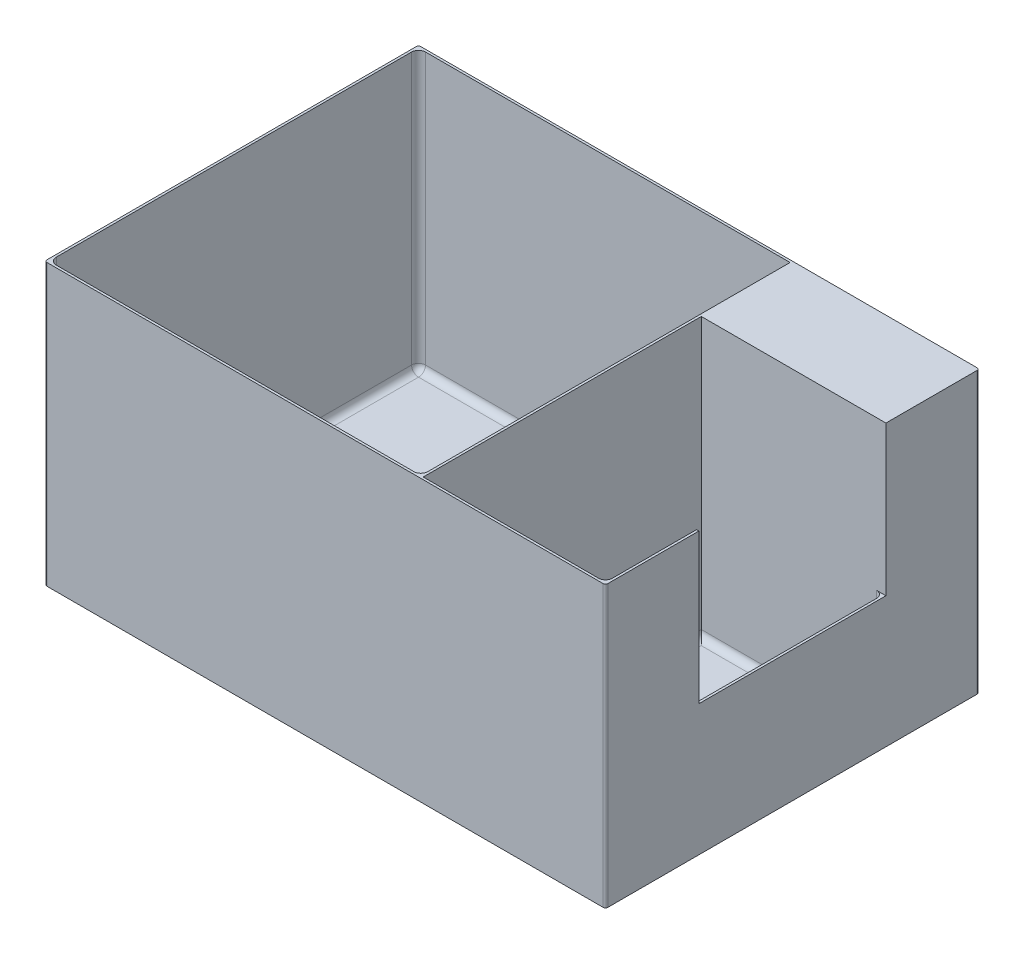
ISO-10303-21;
HEADER;
FILE_DESCRIPTION(('STEP AP214'),'2;1');
FILE_NAME('part.step','',(''),(''),'','','');
FILE_SCHEMA(('AUTOMOTIVE_DESIGN { 1 0 10303 214 1 1 1 1 }'));
ENDSEC;
DATA;
#1=APPLICATION_CONTEXT('core data for automotive mechanical design processes');
#2=APPLICATION_PROTOCOL_DEFINITION('international standard','automotive_design',2000,#1);
#3=PRODUCT_CONTEXT('',#1,'mechanical');
#4=PRODUCT('Part','Part','',(#3));
#5=PRODUCT_RELATED_PRODUCT_CATEGORY('part','',(#4));
#6=PRODUCT_DEFINITION_FORMATION('','',#4);
#7=PRODUCT_DEFINITION_CONTEXT('part definition',#1,'design');
#8=PRODUCT_DEFINITION('design','',#6,#7);
#9=PRODUCT_DEFINITION_SHAPE('','',#8);
#10=(LENGTH_UNIT() NAMED_UNIT(*) SI_UNIT(.MILLI.,.METRE.));
#11=(NAMED_UNIT(*) PLANE_ANGLE_UNIT() SI_UNIT($,.RADIAN.));
#12=(NAMED_UNIT(*) SI_UNIT($,.STERADIAN.) SOLID_ANGLE_UNIT());
#13=UNCERTAINTY_MEASURE_WITH_UNIT(LENGTH_MEASURE(1.E-05),#10,'distance_accuracy_value','');
#14=(GEOMETRIC_REPRESENTATION_CONTEXT(3) GLOBAL_UNCERTAINTY_ASSIGNED_CONTEXT((#13)) GLOBAL_UNIT_ASSIGNED_CONTEXT((#10,
#11,#12)) REPRESENTATION_CONTEXT('',''));
#15=CARTESIAN_POINT('',(0.,0.,0.));
#16=DIRECTION('',(0.,0.,1.));
#17=DIRECTION('',(1.,0.,0.));
#18=AXIS2_PLACEMENT_3D('',#15,#16,#17);
#19=CARTESIAN_POINT('',(120.,120.,80.));
#20=DIRECTION('',(-1.,0.,0.));
#21=DIRECTION('',(0.,0.,1.));
#22=AXIS2_PLACEMENT_3D('',#19,#20,#21);
#23=PLANE('',#22);
#24=DIRECTION('',(0.,0.,-1.));
#25=VECTOR('',#24,1.);
#26=CARTESIAN_POINT('',(120.,0.,80.));
#27=LINE('',#26,#25);
#28=CARTESIAN_POINT('',(120.,0.,79.));
#29=VERTEX_POINT('',#28);
#30=CARTESIAN_POINT('',(120.,0.,-79.));
#31=VERTEX_POINT('',#30);
#32=EDGE_CURVE('E284',#29,#31,#27,.T.);
#33=ORIENTED_EDGE('',*,*,#32,.T.);
#34=DIRECTION('',(0.,-1.,0.));
#35=VECTOR('',#34,1.);
#36=CARTESIAN_POINT('',(120.,120.,-79.));
#37=LINE('',#36,#35);
#38=CARTESIAN_POINT('',(120.,120.,-79.));
#39=VERTEX_POINT('',#38);
#40=EDGE_CURVE('E260',#31,#39,#37,.F.);
#41=ORIENTED_EDGE('',*,*,#40,.T.);
#42=DIRECTION('',(0.,0.,-1.));
#43=VECTOR('',#42,1.);
#44=CARTESIAN_POINT('',(120.,120.,80.));
#45=LINE('',#44,#43);
#46=CARTESIAN_POINT('',(120.,120.,-40.));
#47=VERTEX_POINT('',#46);
#48=EDGE_CURVE('E236',#47,#39,#45,.T.);
#49=ORIENTED_EDGE('',*,*,#48,.F.);
#50=DIRECTION('',(0.,1.,0.));
#51=VECTOR('',#50,1.);
#52=CARTESIAN_POINT('',(120.,56.,-40.));
#53=LINE('',#52,#51);
#54=CARTESIAN_POINT('',(120.,56.,-40.));
#55=VERTEX_POINT('',#54);
#56=EDGE_CURVE('E247',#55,#47,#53,.T.);
#57=ORIENTED_EDGE('',*,*,#56,.F.);
#58=DIRECTION('',(0.,0.,-1.));
#59=VECTOR('',#58,1.);
#60=CARTESIAN_POINT('',(120.,56.,40.));
#61=LINE('',#60,#59);
#62=CARTESIAN_POINT('',(120.,56.,40.));
#63=VERTEX_POINT('',#62);
#64=EDGE_CURVE('E581',#63,#55,#61,.T.);
#65=ORIENTED_EDGE('',*,*,#64,.F.);
#66=DIRECTION('',(0.,-1.,0.));
#67=VECTOR('',#66,1.);
#68=CARTESIAN_POINT('',(120.,56.,40.));
#69=LINE('',#68,#67);
#70=CARTESIAN_POINT('',(120.,120.,40.));
#71=VERTEX_POINT('',#70);
#72=EDGE_CURVE('E255',#71,#63,#69,.T.);
#73=ORIENTED_EDGE('',*,*,#72,.F.);
#74=CARTESIAN_POINT('',(120.,120.,79.));
#75=VERTEX_POINT('',#74);
#76=EDGE_CURVE('E262',#75,#71,#45,.T.);
#77=ORIENTED_EDGE('',*,*,#76,.F.);
#78=DIRECTION('',(0.,-1.,0.));
#79=VECTOR('',#78,1.);
#80=CARTESIAN_POINT('',(120.,120.,79.));
#81=LINE('',#80,#79);
#82=EDGE_CURVE('E332',#75,#29,#81,.T.);
#83=ORIENTED_EDGE('',*,*,#82,.T.);
#84=EDGE_LOOP('',(#33,#41,#49,#57,#65,#73,#77,#83));
#85=FACE_BOUND('',#84,.T.);
#86=ADVANCED_FACE('F43',(#85),#23,.F.);
#87=CARTESIAN_POINT('',(-120.,120.,-80.));
#88=DIRECTION('',(0.,0.,1.));
#89=DIRECTION('',(1.,0.,0.));
#90=AXIS2_PLACEMENT_3D('',#87,#88,#89);
#91=PLANE('',#90);
#92=DIRECTION('',(-1.,0.,0.));
#93=VECTOR('',#92,1.);
#94=CARTESIAN_POINT('',(-120.,0.,-80.));
#95=LINE('',#94,#93);
#96=CARTESIAN_POINT('',(119.,0.,-80.));
#97=VERTEX_POINT('',#96);
#98=CARTESIAN_POINT('',(-119.,0.,-80.));
#99=VERTEX_POINT('',#98);
#100=EDGE_CURVE('E287',#97,#99,#95,.T.);
#101=ORIENTED_EDGE('',*,*,#100,.T.);
#102=DIRECTION('',(0.,-1.,0.));
#103=VECTOR('',#102,1.);
#104=CARTESIAN_POINT('',(-119.,120.,-80.));
#105=LINE('',#104,#103);
#106=CARTESIAN_POINT('',(-119.,120.,-80.));
#107=VERTEX_POINT('',#106);
#108=EDGE_CURVE('E317',#99,#107,#105,.F.);
#109=ORIENTED_EDGE('',*,*,#108,.T.);
#110=DIRECTION('',(-1.,0.,0.));
#111=VECTOR('',#110,1.);
#112=CARTESIAN_POINT('',(-120.,120.,-80.));
#113=LINE('',#112,#111);
#114=CARTESIAN_POINT('',(119.,120.,-80.));
#115=VERTEX_POINT('',#114);
#116=EDGE_CURVE('E267',#115,#107,#113,.T.);
#117=ORIENTED_EDGE('',*,*,#116,.F.);
#118=DIRECTION('',(0.,-1.,0.));
#119=VECTOR('',#118,1.);
#120=CARTESIAN_POINT('',(119.,120.,-80.));
#121=LINE('',#120,#119);
#122=EDGE_CURVE('E313',#115,#97,#121,.T.);
#123=ORIENTED_EDGE('',*,*,#122,.T.);
#124=EDGE_LOOP('',(#101,#109,#117,#123));
#125=FACE_BOUND('',#124,.T.);
#126=ADVANCED_FACE('F631',(#125),#91,.F.);
#127=CARTESIAN_POINT('',(-120.,120.,80.));
#128=DIRECTION('',(1.,0.,0.));
#129=DIRECTION('',(0.,0.,-1.));
#130=AXIS2_PLACEMENT_3D('',#127,#128,#129);
#131=PLANE('',#130);
#132=DIRECTION('',(0.,0.,1.));
#133=VECTOR('',#132,1.);
#134=CARTESIAN_POINT('',(-120.,120.,80.));
#135=LINE('',#134,#133);
#136=CARTESIAN_POINT('',(-120.,120.,-79.));
#137=VERTEX_POINT('',#136);
#138=CARTESIAN_POINT('',(-120.,120.,79.));
#139=VERTEX_POINT('',#138);
#140=EDGE_CURVE('E275',#137,#139,#135,.T.);
#141=ORIENTED_EDGE('',*,*,#140,.F.);
#142=DIRECTION('',(0.,-1.,0.));
#143=VECTOR('',#142,1.);
#144=CARTESIAN_POINT('',(-120.,120.,-79.));
#145=LINE('',#144,#143);
#146=CARTESIAN_POINT('',(-120.,0.,-79.));
#147=VERTEX_POINT('',#146);
#148=EDGE_CURVE('E297',#137,#147,#145,.T.);
#149=ORIENTED_EDGE('',*,*,#148,.T.);
#150=DIRECTION('',(0.,0.,1.));
#151=VECTOR('',#150,1.);
#152=CARTESIAN_POINT('',(-120.,0.,80.));
#153=LINE('',#152,#151);
#154=CARTESIAN_POINT('',(-120.,0.,79.));
#155=VERTEX_POINT('',#154);
#156=EDGE_CURVE('E269',#147,#155,#153,.T.);
#157=ORIENTED_EDGE('',*,*,#156,.T.);
#158=DIRECTION('',(0.,-1.,0.));
#159=VECTOR('',#158,1.);
#160=CARTESIAN_POINT('',(-120.,120.,79.));
#161=LINE('',#160,#159);
#162=EDGE_CURVE('E283',#155,#139,#161,.F.);
#163=ORIENTED_EDGE('',*,*,#162,.T.);
#164=EDGE_LOOP('',(#141,#149,#157,#163));
#165=FACE_BOUND('',#164,.T.);
#166=ADVANCED_FACE('F623',(#165),#131,.F.);
#167=CARTESIAN_POINT('',(-120.,120.,80.));
#168=DIRECTION('',(0.,0.,-1.));
#169=DIRECTION('',(-1.,0.,0.));
#170=AXIS2_PLACEMENT_3D('',#167,#168,#169);
#171=PLANE('',#170);
#172=DIRECTION('',(1.,0.,0.));
#173=VECTOR('',#172,1.);
#174=CARTESIAN_POINT('',(-120.,120.,80.));
#175=LINE('',#174,#173);
#176=CARTESIAN_POINT('',(-119.,120.,80.));
#177=VERTEX_POINT('',#176);
#178=CARTESIAN_POINT('',(119.,120.,80.));
#179=VERTEX_POINT('',#178);
#180=EDGE_CURVE('E279',#177,#179,#175,.T.);
#181=ORIENTED_EDGE('',*,*,#180,.F.);
#182=DIRECTION('',(0.,-1.,0.));
#183=VECTOR('',#182,1.);
#184=CARTESIAN_POINT('',(-119.,120.,80.));
#185=LINE('',#184,#183);
#186=CARTESIAN_POINT('',(-119.,0.,80.));
#187=VERTEX_POINT('',#186);
#188=EDGE_CURVE('E341',#177,#187,#185,.T.);
#189=ORIENTED_EDGE('',*,*,#188,.T.);
#190=DIRECTION('',(1.,0.,0.));
#191=VECTOR('',#190,1.);
#192=CARTESIAN_POINT('',(-120.,0.,80.));
#193=LINE('',#192,#191);
#194=CARTESIAN_POINT('',(119.,0.,80.));
#195=VERTEX_POINT('',#194);
#196=EDGE_CURVE('E263',#187,#195,#193,.T.);
#197=ORIENTED_EDGE('',*,*,#196,.T.);
#198=DIRECTION('',(0.,-1.,0.));
#199=VECTOR('',#198,1.);
#200=CARTESIAN_POINT('',(119.,120.,80.));
#201=LINE('',#200,#199);
#202=EDGE_CURVE('E338',#195,#179,#201,.F.);
#203=ORIENTED_EDGE('',*,*,#202,.T.);
#204=EDGE_LOOP('',(#181,#189,#197,#203));
#205=FACE_BOUND('',#204,.T.);
#206=ADVANCED_FACE('F615',(#205),#171,.F.);
#207=CARTESIAN_POINT('',(0.,120.,0.));
#208=DIRECTION('',(0.,-1.,0.));
#209=DIRECTION('',(0.,0.,-1.));
#210=AXIS2_PLACEMENT_3D('',#207,#208,#209);
#211=PLANE('',#210);
#212=DIRECTION('',(-1.,0.,0.));
#213=VECTOR('',#212,1.);
#214=CARTESIAN_POINT('',(-119.,120.,-79.));
#215=LINE('',#214,#213);
#216=CARTESIAN_POINT('',(40.,120.,-79.));
#217=VERTEX_POINT('',#216);
#218=CARTESIAN_POINT('',(-116.,120.,-79.));
#219=VERTEX_POINT('',#218);
#220=EDGE_CURVE('E561',#217,#219,#215,.T.);
#221=ORIENTED_EDGE('',*,*,#220,.F.);
#222=DIRECTION('',(0.,0.,-1.));
#223=VECTOR('',#222,1.);
#224=CARTESIAN_POINT('',(40.,120.,79.));
#225=LINE('',#224,#223);
#226=CARTESIAN_POINT('',(40.,120.,76.));
#227=VERTEX_POINT('',#226);
#228=EDGE_CURVE('E558',#227,#217,#225,.T.);
#229=ORIENTED_EDGE('',*,*,#228,.F.);
#230=CARTESIAN_POINT('',(37.,120.,76.));
#231=DIRECTION('',(0.,-1.,0.));
#232=DIRECTION('',(0.,0.,-1.));
#233=AXIS2_PLACEMENT_3D('',#230,#231,#232);
#234=CIRCLE('',#233,3.);
#235=CARTESIAN_POINT('',(37.,120.,79.));
#236=VERTEX_POINT('',#235);
#237=EDGE_CURVE('E424',#227,#236,#234,.T.);
#238=ORIENTED_EDGE('',*,*,#237,.T.);
#239=DIRECTION('',(1.,0.,0.));
#240=VECTOR('',#239,1.);
#241=CARTESIAN_POINT('',(-119.,120.,79.));
#242=LINE('',#241,#240);
#243=CARTESIAN_POINT('',(-116.,120.,79.));
#244=VERTEX_POINT('',#243);
#245=EDGE_CURVE('E569',#244,#236,#242,.T.);
#246=ORIENTED_EDGE('',*,*,#245,.F.);
#247=CARTESIAN_POINT('',(-116.,120.,76.));
#248=DIRECTION('',(0.,-1.,0.));
#249=DIRECTION('',(0.,0.,-1.));
#250=AXIS2_PLACEMENT_3D('',#247,#248,#249);
#251=CIRCLE('',#250,3.);
#252=CARTESIAN_POINT('',(-119.,120.,76.));
#253=VERTEX_POINT('',#252);
#254=EDGE_CURVE('E427',#244,#253,#251,.T.);
#255=ORIENTED_EDGE('',*,*,#254,.T.);
#256=DIRECTION('',(0.,0.,1.));
#257=VECTOR('',#256,1.);
#258=CARTESIAN_POINT('',(-119.,120.,79.));
#259=LINE('',#258,#257);
#260=CARTESIAN_POINT('',(-119.,120.,-76.));
#261=VERTEX_POINT('',#260);
#262=EDGE_CURVE('E565',#261,#253,#259,.T.);
#263=ORIENTED_EDGE('',*,*,#262,.F.);
#264=CARTESIAN_POINT('',(-116.,120.,-76.));
#265=DIRECTION('',(0.,-1.,0.));
#266=DIRECTION('',(0.,0.,-1.));
#267=AXIS2_PLACEMENT_3D('',#264,#265,#266);
#268=CIRCLE('',#267,3.);
#269=EDGE_CURVE('E430',#261,#219,#268,.T.);
#270=ORIENTED_EDGE('',*,*,#269,.T.);
#271=EDGE_LOOP('',(#221,#229,#238,#246,#255,#263,#270));
#272=FACE_BOUND('',#271,.T.);
#273=ORIENTED_EDGE('',*,*,#116,.T.);
#274=CARTESIAN_POINT('',(-119.,120.,-79.));
#275=DIRECTION('',(0.,-1.,0.));
#276=DIRECTION('',(0.,0.,-1.));
#277=AXIS2_PLACEMENT_3D('',#274,#275,#276);
#278=CIRCLE('',#277,1.);
#279=EDGE_CURVE('E329',#107,#137,#278,.F.);
#280=ORIENTED_EDGE('',*,*,#279,.T.);
#281=ORIENTED_EDGE('',*,*,#140,.T.);
#282=CARTESIAN_POINT('',(-119.,120.,79.));
#283=DIRECTION('',(0.,-1.,0.));
#284=DIRECTION('',(0.,0.,-1.));
#285=AXIS2_PLACEMENT_3D('',#282,#283,#284);
#286=CIRCLE('',#285,1.);
#287=EDGE_CURVE('E323',#139,#177,#286,.F.);
#288=ORIENTED_EDGE('',*,*,#287,.T.);
#289=ORIENTED_EDGE('',*,*,#180,.T.);
#290=CARTESIAN_POINT('',(119.,120.,79.));
#291=DIRECTION('',(0.,-1.,0.));
#292=DIRECTION('',(0.,0.,-1.));
#293=AXIS2_PLACEMENT_3D('',#290,#291,#292);
#294=CIRCLE('',#293,1.);
#295=EDGE_CURVE('E320',#179,#75,#294,.F.);
#296=ORIENTED_EDGE('',*,*,#295,.T.);
#297=ORIENTED_EDGE('',*,*,#76,.T.);
#298=DIRECTION('',(1.,0.,0.));
#299=VECTOR('',#298,1.);
#300=CARTESIAN_POINT('',(-120.001,120.,40.));
#301=LINE('',#300,#299);
#302=CARTESIAN_POINT('',(119.,120.,40.));
#303=VERTEX_POINT('',#302);
#304=EDGE_CURVE('E577',#303,#71,#301,.T.);
#305=ORIENTED_EDGE('',*,*,#304,.F.);
#306=DIRECTION('',(0.,0.,-1.));
#307=VECTOR('',#306,1.);
#308=CARTESIAN_POINT('',(119.,120.,79.));
#309=LINE('',#308,#307);
#310=CARTESIAN_POINT('',(119.,120.,76.));
#311=VERTEX_POINT('',#310);
#312=EDGE_CURVE('E244',#311,#303,#309,.T.);
#313=ORIENTED_EDGE('',*,*,#312,.F.);
#314=CARTESIAN_POINT('',(116.,120.,76.));
#315=DIRECTION('',(0.,-1.,0.));
#316=DIRECTION('',(0.,0.,-1.));
#317=AXIS2_PLACEMENT_3D('',#314,#315,#316);
#318=CIRCLE('',#317,3.);
#319=CARTESIAN_POINT('',(116.,120.,79.));
#320=VERTEX_POINT('',#319);
#321=EDGE_CURVE('E11',#311,#320,#318,.T.);
#322=ORIENTED_EDGE('',*,*,#321,.T.);
#323=DIRECTION('',(1.,0.,0.));
#324=VECTOR('',#323,1.);
#325=CARTESIAN_POINT('',(41.,120.,79.));
#326=LINE('',#325,#324);
#327=CARTESIAN_POINT('',(41.,120.,79.));
#328=VERTEX_POINT('',#327);
#329=EDGE_CURVE('E547',#328,#320,#326,.T.);
#330=ORIENTED_EDGE('',*,*,#329,.F.);
#331=DIRECTION('',(0.,0.,1.));
#332=VECTOR('',#331,1.);
#333=CARTESIAN_POINT('',(41.,120.,79.));
#334=LINE('',#333,#332);
#335=CARTESIAN_POINT('',(41.,120.,-40.));
#336=VERTEX_POINT('',#335);
#337=EDGE_CURVE('E240',#336,#328,#334,.T.);
#338=ORIENTED_EDGE('',*,*,#337,.F.);
#339=DIRECTION('',(-1.,0.,0.));
#340=VECTOR('',#339,1.);
#341=CARTESIAN_POINT('',(41.,120.,-40.));
#342=LINE('',#341,#340);
#343=EDGE_CURVE('E231',#47,#336,#342,.T.);
#344=ORIENTED_EDGE('',*,*,#343,.F.);
#345=ORIENTED_EDGE('',*,*,#48,.T.);
#346=CARTESIAN_POINT('',(119.,120.,-79.));
#347=DIRECTION('',(0.,-1.,0.));
#348=DIRECTION('',(0.,0.,-1.));
#349=AXIS2_PLACEMENT_3D('',#346,#347,#348);
#350=CIRCLE('',#349,1.);
#351=EDGE_CURVE('E326',#39,#115,#350,.F.);
#352=ORIENTED_EDGE('',*,*,#351,.T.);
#353=EDGE_LOOP('',(#273,#280,#281,#288,#289,#296,#297,#305,#313,#322,#330,#338,#344,#345,#352));
#354=FACE_BOUND('',#353,.T.);
#355=ADVANCED_FACE('F234',(#272,#354),#211,.F.);
#356=CARTESIAN_POINT('',(0.,0.,0.));
#357=DIRECTION('',(0.,-1.,0.));
#358=DIRECTION('',(0.,0.,-1.));
#359=AXIS2_PLACEMENT_3D('',#356,#357,#358);
#360=PLANE('',#359);
#361=ORIENTED_EDGE('',*,*,#156,.F.);
#362=CARTESIAN_POINT('',(-119.,0.,-79.));
#363=DIRECTION('',(0.,-1.,0.));
#364=DIRECTION('',(0.,0.,-1.));
#365=AXIS2_PLACEMENT_3D('',#362,#363,#364);
#366=CIRCLE('',#365,1.);
#367=EDGE_CURVE('E310',#147,#99,#366,.T.);
#368=ORIENTED_EDGE('',*,*,#367,.T.);
#369=ORIENTED_EDGE('',*,*,#100,.F.);
#370=CARTESIAN_POINT('',(119.,0.,-79.));
#371=DIRECTION('',(0.,-1.,0.));
#372=DIRECTION('',(0.,0.,-1.));
#373=AXIS2_PLACEMENT_3D('',#370,#371,#372);
#374=CIRCLE('',#373,1.);
#375=EDGE_CURVE('E307',#97,#31,#374,.T.);
#376=ORIENTED_EDGE('',*,*,#375,.T.);
#377=ORIENTED_EDGE('',*,*,#32,.F.);
#378=CARTESIAN_POINT('',(119.,0.,79.));
#379=DIRECTION('',(0.,-1.,0.));
#380=DIRECTION('',(0.,0.,-1.));
#381=AXIS2_PLACEMENT_3D('',#378,#379,#380);
#382=CIRCLE('',#381,1.);
#383=EDGE_CURVE('E301',#29,#195,#382,.T.);
#384=ORIENTED_EDGE('',*,*,#383,.T.);
#385=ORIENTED_EDGE('',*,*,#196,.F.);
#386=CARTESIAN_POINT('',(-119.,0.,79.));
#387=DIRECTION('',(0.,-1.,0.));
#388=DIRECTION('',(0.,0.,-1.));
#389=AXIS2_PLACEMENT_3D('',#386,#387,#388);
#390=CIRCLE('',#389,1.);
#391=EDGE_CURVE('E304',#187,#155,#390,.T.);
#392=ORIENTED_EDGE('',*,*,#391,.T.);
#393=EDGE_LOOP('',(#361,#368,#369,#376,#377,#384,#385,#392));
#394=FACE_BOUND('',#393,.T.);
#395=ADVANCED_FACE('F612',(#394),#360,.T.);
#396=CARTESIAN_POINT('',(119.,1.,79.));
#397=DIRECTION('',(1.,0.,0.));
#398=DIRECTION('',(0.,0.,-1.));
#399=AXIS2_PLACEMENT_3D('',#396,#397,#398);
#400=PLANE('',#399);
#401=DIRECTION('',(0.,0.,1.));
#402=VECTOR('',#401,1.);
#403=CARTESIAN_POINT('',(119.,56.,40.));
#404=LINE('',#403,#402);
#405=CARTESIAN_POINT('',(119.,56.,-37.));
#406=VERTEX_POINT('',#405);
#407=CARTESIAN_POINT('',(119.,56.,40.));
#408=VERTEX_POINT('',#407);
#409=EDGE_CURVE('E256',#406,#408,#404,.T.);
#410=ORIENTED_EDGE('',*,*,#409,.F.);
#411=DIRECTION('',(0.,1.,0.));
#412=VECTOR('',#411,1.);
#413=CARTESIAN_POINT('',(119.,1.,-37.));
#414=LINE('',#413,#412);
#415=CARTESIAN_POINT('',(119.,4.,-37.));
#416=VERTEX_POINT('',#415);
#417=EDGE_CURVE('E388',#406,#416,#414,.F.);
#418=ORIENTED_EDGE('',*,*,#417,.T.);
#419=DIRECTION('',(0.,0.,-1.));
#420=VECTOR('',#419,1.);
#421=CARTESIAN_POINT('',(119.,4.,79.));
#422=LINE('',#421,#420);
#423=CARTESIAN_POINT('',(119.,4.,76.));
#424=VERTEX_POINT('',#423);
#425=EDGE_CURVE('E382',#416,#424,#422,.F.);
#426=ORIENTED_EDGE('',*,*,#425,.T.);
#427=DIRECTION('',(0.,1.,0.));
#428=VECTOR('',#427,1.);
#429=CARTESIAN_POINT('',(119.,120.,76.));
#430=LINE('',#429,#428);
#431=EDGE_CURVE('E385',#424,#311,#430,.T.);
#432=ORIENTED_EDGE('',*,*,#431,.T.);
#433=ORIENTED_EDGE('',*,*,#312,.T.);
#434=DIRECTION('',(0.,1.,0.));
#435=VECTOR('',#434,1.);
#436=CARTESIAN_POINT('',(119.,56.,40.));
#437=LINE('',#436,#435);
#438=EDGE_CURVE('E474',#408,#303,#437,.T.);
#439=ORIENTED_EDGE('',*,*,#438,.F.);
#440=EDGE_LOOP('',(#410,#418,#426,#432,#433,#439));
#441=FACE_BOUND('',#440,.T.);
#442=ADVANCED_FACE('F657',(#441),#400,.F.);
#443=CARTESIAN_POINT('',(41.,1.,79.));
#444=DIRECTION('',(0.,0.,1.));
#445=DIRECTION('',(1.,0.,0.));
#446=AXIS2_PLACEMENT_3D('',#443,#444,#445);
#447=PLANE('',#446);
#448=ORIENTED_EDGE('',*,*,#329,.T.);
#449=DIRECTION('',(0.,1.,0.));
#450=VECTOR('',#449,1.);
#451=CARTESIAN_POINT('',(116.,1.,79.));
#452=LINE('',#451,#450);
#453=CARTESIAN_POINT('',(116.,4.,79.));
#454=VERTEX_POINT('',#453);
#455=EDGE_CURVE('E394',#320,#454,#452,.F.);
#456=ORIENTED_EDGE('',*,*,#455,.T.);
#457=DIRECTION('',(1.,0.,0.));
#458=VECTOR('',#457,1.);
#459=CARTESIAN_POINT('',(41.,4.,79.));
#460=LINE('',#459,#458);
#461=CARTESIAN_POINT('',(41.,4.,79.));
#462=VERTEX_POINT('',#461);
#463=EDGE_CURVE('E391',#454,#462,#460,.F.);
#464=ORIENTED_EDGE('',*,*,#463,.T.);
#465=DIRECTION('',(0.,1.,0.));
#466=VECTOR('',#465,1.);
#467=CARTESIAN_POINT('',(41.,1.,79.));
#468=LINE('',#467,#466);
#469=EDGE_CURVE('E540',#462,#328,#468,.T.);
#470=ORIENTED_EDGE('',*,*,#469,.T.);
#471=EDGE_LOOP('',(#448,#456,#464,#470));
#472=FACE_BOUND('',#471,.T.);
#473=ADVANCED_FACE('F539',(#472),#447,.F.);
#474=CARTESIAN_POINT('',(41.,1.,79.));
#475=DIRECTION('',(-1.,0.,0.));
#476=DIRECTION('',(0.,0.,1.));
#477=AXIS2_PLACEMENT_3D('',#474,#475,#476);
#478=PLANE('',#477);
#479=ORIENTED_EDGE('',*,*,#469,.F.);
#480=DIRECTION('',(0.,0.,1.));
#481=VECTOR('',#480,1.);
#482=CARTESIAN_POINT('',(41.,4.,-40.));
#483=LINE('',#482,#481);
#484=CARTESIAN_POINT('',(41.,4.,-40.));
#485=VERTEX_POINT('',#484);
#486=EDGE_CURVE('E421',#462,#485,#483,.F.);
#487=ORIENTED_EDGE('',*,*,#486,.T.);
#488=DIRECTION('',(0.,1.,0.));
#489=VECTOR('',#488,1.);
#490=CARTESIAN_POINT('',(41.,1.,-40.));
#491=LINE('',#490,#489);
#492=EDGE_CURVE('E522',#485,#336,#491,.T.);
#493=ORIENTED_EDGE('',*,*,#492,.T.);
#494=ORIENTED_EDGE('',*,*,#337,.T.);
#495=EDGE_LOOP('',(#479,#487,#493,#494));
#496=FACE_BOUND('',#495,.T.);
#497=ADVANCED_FACE('F542',(#496),#478,.F.);
#498=CARTESIAN_POINT('',(41.,1.,-40.));
#499=DIRECTION('',(0.,0.,-1.));
#500=DIRECTION('',(-1.,0.,0.));
#501=AXIS2_PLACEMENT_3D('',#498,#499,#500);
#502=PLANE('',#501);
#503=DIRECTION('',(0.,1.,0.));
#504=VECTOR('',#503,1.);
#505=CARTESIAN_POINT('',(116.,56.,-40.));
#506=LINE('',#505,#504);
#507=CARTESIAN_POINT('',(116.,4.,-40.));
#508=VERTEX_POINT('',#507);
#509=CARTESIAN_POINT('',(116.,56.,-40.));
#510=VERTEX_POINT('',#509);
#511=EDGE_CURVE('E379',#508,#510,#506,.T.);
#512=ORIENTED_EDGE('',*,*,#511,.T.);
#513=DIRECTION('',(1.,0.,0.));
#514=VECTOR('',#513,1.);
#515=CARTESIAN_POINT('',(-120.001,56.,-40.));
#516=LINE('',#515,#514);
#517=EDGE_CURVE('E250',#510,#55,#516,.T.);
#518=ORIENTED_EDGE('',*,*,#517,.T.);
#519=ORIENTED_EDGE('',*,*,#56,.T.);
#520=ORIENTED_EDGE('',*,*,#343,.T.);
#521=ORIENTED_EDGE('',*,*,#492,.F.);
#522=DIRECTION('',(-1.,0.,0.));
#523=VECTOR('',#522,1.);
#524=CARTESIAN_POINT('',(119.,4.,-40.));
#525=LINE('',#524,#523);
#526=EDGE_CURVE('E376',#485,#508,#525,.F.);
#527=ORIENTED_EDGE('',*,*,#526,.T.);
#528=EDGE_LOOP('',(#512,#518,#519,#520,#521,#527));
#529=FACE_BOUND('',#528,.T.);
#530=ADVANCED_FACE('F249',(#529),#502,.F.);
#531=CARTESIAN_POINT('',(0.,1.,0.));
#532=DIRECTION('',(0.,-1.,0.));
#533=DIRECTION('',(0.,0.,-1.));
#534=AXIS2_PLACEMENT_3D('',#531,#532,#533);
#535=PLANE('',#534);
#536=DIRECTION('',(0.,0.,1.));
#537=VECTOR('',#536,1.);
#538=CARTESIAN_POINT('',(44.,1.,79.));
#539=LINE('',#538,#537);
#540=CARTESIAN_POINT('',(44.,1.,-37.));
#541=VERTEX_POINT('',#540);
#542=CARTESIAN_POINT('',(44.,1.,76.));
#543=VERTEX_POINT('',#542);
#544=EDGE_CURVE('E410',#541,#543,#539,.T.);
#545=ORIENTED_EDGE('',*,*,#544,.T.);
#546=DIRECTION('',(1.,0.,0.));
#547=VECTOR('',#546,1.);
#548=CARTESIAN_POINT('',(119.,1.,76.));
#549=LINE('',#548,#547);
#550=CARTESIAN_POINT('',(116.,1.,76.));
#551=VERTEX_POINT('',#550);
#552=EDGE_CURVE('E418',#543,#551,#549,.T.);
#553=ORIENTED_EDGE('',*,*,#552,.T.);
#554=DIRECTION('',(0.,0.,-1.));
#555=VECTOR('',#554,1.);
#556=CARTESIAN_POINT('',(116.,1.,-40.));
#557=LINE('',#556,#555);
#558=CARTESIAN_POINT('',(116.,1.,-37.));
#559=VERTEX_POINT('',#558);
#560=EDGE_CURVE('E61',#551,#559,#557,.T.);
#561=ORIENTED_EDGE('',*,*,#560,.T.);
#562=DIRECTION('',(-1.,0.,0.));
#563=VECTOR('',#562,1.);
#564=CARTESIAN_POINT('',(41.,1.,-37.));
#565=LINE('',#564,#563);
#566=EDGE_CURVE('E413',#559,#541,#565,.T.);
#567=ORIENTED_EDGE('',*,*,#566,.T.);
#568=EDGE_LOOP('',(#545,#553,#561,#567));
#569=FACE_BOUND('',#568,.T.);
#570=ADVANCED_FACE('F527',(#569),#535,.F.);
#571=CARTESIAN_POINT('',(40.,1.,79.));
#572=DIRECTION('',(1.,0.,0.));
#573=DIRECTION('',(0.,0.,-1.));
#574=AXIS2_PLACEMENT_3D('',#571,#572,#573);
#575=PLANE('',#574);
#576=DIRECTION('',(0.,0.,-1.));
#577=VECTOR('',#576,1.);
#578=CARTESIAN_POINT('',(40.,4.,79.));
#579=LINE('',#578,#577);
#580=CARTESIAN_POINT('',(40.,4.,-79.));
#581=VERTEX_POINT('',#580);
#582=CARTESIAN_POINT('',(40.,4.,76.));
#583=VERTEX_POINT('',#582);
#584=EDGE_CURVE('E345',#581,#583,#579,.F.);
#585=ORIENTED_EDGE('',*,*,#584,.T.);
#586=DIRECTION('',(0.,1.,0.));
#587=VECTOR('',#586,1.);
#588=CARTESIAN_POINT('',(40.,120.,76.));
#589=LINE('',#588,#587);
#590=EDGE_CURVE('E348',#583,#227,#589,.T.);
#591=ORIENTED_EDGE('',*,*,#590,.T.);
#592=ORIENTED_EDGE('',*,*,#228,.T.);
#593=DIRECTION('',(0.,1.,0.));
#594=VECTOR('',#593,1.);
#595=CARTESIAN_POINT('',(40.,1.,-79.));
#596=LINE('',#595,#594);
#597=EDGE_CURVE('E288',#581,#217,#596,.T.);
#598=ORIENTED_EDGE('',*,*,#597,.F.);
#599=EDGE_LOOP('',(#585,#591,#592,#598));
#600=FACE_BOUND('',#599,.T.);
#601=ADVANCED_FACE('F663',(#600),#575,.F.);
#602=CARTESIAN_POINT('',(-119.,1.,79.));
#603=DIRECTION('',(0.,0.,1.));
#604=DIRECTION('',(1.,0.,0.));
#605=AXIS2_PLACEMENT_3D('',#602,#603,#604);
#606=PLANE('',#605);
#607=ORIENTED_EDGE('',*,*,#245,.T.);
#608=DIRECTION('',(0.,1.,0.));
#609=VECTOR('',#608,1.);
#610=CARTESIAN_POINT('',(37.,1.,79.));
#611=LINE('',#610,#609);
#612=CARTESIAN_POINT('',(37.,4.,79.));
#613=VERTEX_POINT('',#612);
#614=EDGE_CURVE('E358',#236,#613,#611,.F.);
#615=ORIENTED_EDGE('',*,*,#614,.T.);
#616=DIRECTION('',(1.,0.,0.));
#617=VECTOR('',#616,1.);
#618=CARTESIAN_POINT('',(-119.,4.,79.));
#619=LINE('',#618,#617);
#620=CARTESIAN_POINT('',(-116.,4.,79.));
#621=VERTEX_POINT('',#620);
#622=EDGE_CURVE('E352',#613,#621,#619,.F.);
#623=ORIENTED_EDGE('',*,*,#622,.T.);
#624=DIRECTION('',(0.,1.,0.));
#625=VECTOR('',#624,1.);
#626=CARTESIAN_POINT('',(-116.,120.,79.));
#627=LINE('',#626,#625);
#628=EDGE_CURVE('E355',#621,#244,#627,.T.);
#629=ORIENTED_EDGE('',*,*,#628,.T.);
#630=EDGE_LOOP('',(#607,#615,#623,#629));
#631=FACE_BOUND('',#630,.T.);
#632=ADVANCED_FACE('F674',(#631),#606,.F.);
#633=CARTESIAN_POINT('',(-119.,1.,79.));
#634=DIRECTION('',(-1.,0.,0.));
#635=DIRECTION('',(0.,0.,1.));
#636=AXIS2_PLACEMENT_3D('',#633,#634,#635);
#637=PLANE('',#636);
#638=ORIENTED_EDGE('',*,*,#262,.T.);
#639=DIRECTION('',(0.,1.,0.));
#640=VECTOR('',#639,1.);
#641=CARTESIAN_POINT('',(-119.,1.,76.));
#642=LINE('',#641,#640);
#643=CARTESIAN_POINT('',(-119.,4.,76.));
#644=VERTEX_POINT('',#643);
#645=EDGE_CURVE('E367',#253,#644,#642,.F.);
#646=ORIENTED_EDGE('',*,*,#645,.T.);
#647=DIRECTION('',(0.,0.,1.));
#648=VECTOR('',#647,1.);
#649=CARTESIAN_POINT('',(-119.,4.,-79.));
#650=LINE('',#649,#648);
#651=CARTESIAN_POINT('',(-119.,4.,-76.));
#652=VERTEX_POINT('',#651);
#653=EDGE_CURVE('E361',#644,#652,#650,.F.);
#654=ORIENTED_EDGE('',*,*,#653,.T.);
#655=DIRECTION('',(0.,1.,0.));
#656=VECTOR('',#655,1.);
#657=CARTESIAN_POINT('',(-119.,120.,-76.));
#658=LINE('',#657,#656);
#659=EDGE_CURVE('E364',#652,#261,#658,.T.);
#660=ORIENTED_EDGE('',*,*,#659,.T.);
#661=EDGE_LOOP('',(#638,#646,#654,#660));
#662=FACE_BOUND('',#661,.T.);
#663=ADVANCED_FACE('F680',(#662),#637,.F.);
#664=CARTESIAN_POINT('',(-119.,1.,-79.));
#665=DIRECTION('',(0.,0.,-1.));
#666=DIRECTION('',(-1.,0.,0.));
#667=AXIS2_PLACEMENT_3D('',#664,#665,#666);
#668=PLANE('',#667);
#669=ORIENTED_EDGE('',*,*,#220,.T.);
#670=DIRECTION('',(0.,1.,0.));
#671=VECTOR('',#670,1.);
#672=CARTESIAN_POINT('',(-116.,1.,-79.));
#673=LINE('',#672,#671);
#674=CARTESIAN_POINT('',(-116.,4.,-79.));
#675=VERTEX_POINT('',#674);
#676=EDGE_CURVE('E373',#219,#675,#673,.F.);
#677=ORIENTED_EDGE('',*,*,#676,.T.);
#678=DIRECTION('',(-1.,0.,0.));
#679=VECTOR('',#678,1.);
#680=CARTESIAN_POINT('',(40.,4.,-79.));
#681=LINE('',#680,#679);
#682=EDGE_CURVE('E370',#675,#581,#681,.F.);
#683=ORIENTED_EDGE('',*,*,#682,.T.);
#684=ORIENTED_EDGE('',*,*,#597,.T.);
#685=EDGE_LOOP('',(#669,#677,#683,#684));
#686=FACE_BOUND('',#685,.T.);
#687=ADVANCED_FACE('F676',(#686),#668,.F.);
#688=CARTESIAN_POINT('',(0.,1.,0.));
#689=DIRECTION('',(0.,-1.,0.));
#690=DIRECTION('',(0.,0.,-1.));
#691=AXIS2_PLACEMENT_3D('',#688,#689,#690);
#692=PLANE('',#691);
#693=DIRECTION('',(0.,0.,1.));
#694=VECTOR('',#693,1.);
#695=CARTESIAN_POINT('',(-116.,1.,79.));
#696=LINE('',#695,#694);
#697=CARTESIAN_POINT('',(-116.,1.,-76.));
#698=VERTEX_POINT('',#697);
#699=CARTESIAN_POINT('',(-116.,1.,76.));
#700=VERTEX_POINT('',#699);
#701=EDGE_CURVE('E400',#698,#700,#696,.T.);
#702=ORIENTED_EDGE('',*,*,#701,.T.);
#703=DIRECTION('',(1.,0.,0.));
#704=VECTOR('',#703,1.);
#705=CARTESIAN_POINT('',(40.,1.,76.));
#706=LINE('',#705,#704);
#707=CARTESIAN_POINT('',(37.,1.,76.));
#708=VERTEX_POINT('',#707);
#709=EDGE_CURVE('E406',#700,#708,#706,.T.);
#710=ORIENTED_EDGE('',*,*,#709,.T.);
#711=DIRECTION('',(0.,0.,-1.));
#712=VECTOR('',#711,1.);
#713=CARTESIAN_POINT('',(37.,1.,-79.));
#714=LINE('',#713,#712);
#715=CARTESIAN_POINT('',(37.,1.,-76.));
#716=VERTEX_POINT('',#715);
#717=EDGE_CURVE('E403',#708,#716,#714,.T.);
#718=ORIENTED_EDGE('',*,*,#717,.T.);
#719=DIRECTION('',(-1.,0.,0.));
#720=VECTOR('',#719,1.);
#721=CARTESIAN_POINT('',(-119.,1.,-76.));
#722=LINE('',#721,#720);
#723=EDGE_CURVE('E397',#716,#698,#722,.T.);
#724=ORIENTED_EDGE('',*,*,#723,.T.);
#725=EDGE_LOOP('',(#702,#710,#718,#724));
#726=FACE_BOUND('',#725,.T.);
#727=ADVANCED_FACE('F679',(#726),#692,.F.);
#728=CARTESIAN_POINT('',(-120.001,56.,40.));
#729=DIRECTION('',(0.,-1.,0.));
#730=DIRECTION('',(0.,0.,-1.));
#731=AXIS2_PLACEMENT_3D('',#728,#729,#730);
#732=PLANE('',#731);
#733=ORIENTED_EDGE('',*,*,#517,.F.);
#734=CARTESIAN_POINT('',(116.,56.,-37.));
#735=DIRECTION('',(0.,-1.,0.));
#736=DIRECTION('',(0.,0.,-1.));
#737=AXIS2_PLACEMENT_3D('',#734,#735,#736);
#738=CIRCLE('',#737,3.);
#739=EDGE_CURVE('E53',#510,#406,#738,.T.);
#740=ORIENTED_EDGE('',*,*,#739,.T.);
#741=ORIENTED_EDGE('',*,*,#409,.T.);
#742=DIRECTION('',(1.,0.,0.));
#743=VECTOR('',#742,1.);
#744=CARTESIAN_POINT('',(-120.001,56.,40.));
#745=LINE('',#744,#743);
#746=EDGE_CURVE('E549',#408,#63,#745,.T.);
#747=ORIENTED_EDGE('',*,*,#746,.T.);
#748=ORIENTED_EDGE('',*,*,#64,.T.);
#749=EDGE_LOOP('',(#733,#740,#741,#747,#748));
#750=FACE_BOUND('',#749,.T.);
#751=ADVANCED_FACE('F689',(#750),#732,.F.);
#752=CARTESIAN_POINT('',(-120.001,56.,40.));
#753=DIRECTION('',(0.,0.,1.));
#754=DIRECTION('',(1.,0.,0.));
#755=AXIS2_PLACEMENT_3D('',#752,#753,#754);
#756=PLANE('',#755);
#757=ORIENTED_EDGE('',*,*,#438,.T.);
#758=ORIENTED_EDGE('',*,*,#304,.T.);
#759=ORIENTED_EDGE('',*,*,#72,.T.);
#760=ORIENTED_EDGE('',*,*,#746,.F.);
#761=EDGE_LOOP('',(#757,#758,#759,#760));
#762=FACE_BOUND('',#761,.T.);
#763=ADVANCED_FACE('F597',(#762),#756,.F.);
#764=CARTESIAN_POINT('',(-119.,120.,-79.));
#765=DIRECTION('',(0.,-1.,0.));
#766=DIRECTION('',(0.,0.,-1.));
#767=AXIS2_PLACEMENT_3D('',#764,#765,#766);
#768=CYLINDRICAL_SURFACE('',#767,1.);
#769=ORIENTED_EDGE('',*,*,#279,.F.);
#770=ORIENTED_EDGE('',*,*,#108,.F.);
#771=ORIENTED_EDGE('',*,*,#367,.F.);
#772=ORIENTED_EDGE('',*,*,#148,.F.);
#773=EDGE_LOOP('',(#769,#770,#771,#772));
#774=FACE_BOUND('',#773,.T.);
#775=ADVANCED_FACE('F627',(#774),#768,.T.);
#776=CARTESIAN_POINT('',(119.,120.,-79.));
#777=DIRECTION('',(0.,-1.,0.));
#778=DIRECTION('',(0.,0.,-1.));
#779=AXIS2_PLACEMENT_3D('',#776,#777,#778);
#780=CYLINDRICAL_SURFACE('',#779,1.);
#781=ORIENTED_EDGE('',*,*,#351,.F.);
#782=ORIENTED_EDGE('',*,*,#40,.F.);
#783=ORIENTED_EDGE('',*,*,#375,.F.);
#784=ORIENTED_EDGE('',*,*,#122,.F.);
#785=EDGE_LOOP('',(#781,#782,#783,#784));
#786=FACE_BOUND('',#785,.T.);
#787=ADVANCED_FACE('F635',(#786),#780,.T.);
#788=CARTESIAN_POINT('',(-119.,120.,79.));
#789=DIRECTION('',(0.,-1.,0.));
#790=DIRECTION('',(0.,0.,-1.));
#791=AXIS2_PLACEMENT_3D('',#788,#789,#790);
#792=CYLINDRICAL_SURFACE('',#791,1.);
#793=ORIENTED_EDGE('',*,*,#287,.F.);
#794=ORIENTED_EDGE('',*,*,#162,.F.);
#795=ORIENTED_EDGE('',*,*,#391,.F.);
#796=ORIENTED_EDGE('',*,*,#188,.F.);
#797=EDGE_LOOP('',(#793,#794,#795,#796));
#798=FACE_BOUND('',#797,.T.);
#799=ADVANCED_FACE('F619',(#798),#792,.T.);
#800=CARTESIAN_POINT('',(119.,120.,79.));
#801=DIRECTION('',(0.,-1.,0.));
#802=DIRECTION('',(0.,0.,-1.));
#803=AXIS2_PLACEMENT_3D('',#800,#801,#802);
#804=CYLINDRICAL_SURFACE('',#803,1.);
#805=ORIENTED_EDGE('',*,*,#295,.F.);
#806=ORIENTED_EDGE('',*,*,#202,.F.);
#807=ORIENTED_EDGE('',*,*,#383,.F.);
#808=ORIENTED_EDGE('',*,*,#82,.F.);
#809=EDGE_LOOP('',(#805,#806,#807,#808));
#810=FACE_BOUND('',#809,.T.);
#811=ADVANCED_FACE('F607',(#810),#804,.T.);
#812=CARTESIAN_POINT('',(-116.,1.,-76.));
#813=DIRECTION('',(0.,-1.,0.));
#814=DIRECTION('',(0.,0.,-1.));
#815=AXIS2_PLACEMENT_3D('',#812,#813,#814);
#816=CYLINDRICAL_SURFACE('',#815,3.);
#817=ORIENTED_EDGE('',*,*,#269,.F.);
#818=ORIENTED_EDGE('',*,*,#659,.F.);
#819=CARTESIAN_POINT('',(-116.,4.,-76.));
#820=DIRECTION('',(0.,1.,0.));
#821=DIRECTION('',(0.,0.,1.));
#822=AXIS2_PLACEMENT_3D('',#819,#820,#821);
#823=CIRCLE('',#822,3.);
#824=EDGE_CURVE('E466',#675,#652,#823,.T.);
#825=ORIENTED_EDGE('',*,*,#824,.F.);
#826=ORIENTED_EDGE('',*,*,#676,.F.);
#827=EDGE_LOOP('',(#817,#818,#825,#826));
#828=FACE_BOUND('',#827,.T.);
#829=ADVANCED_FACE('F734',(#828),#816,.F.);
#830=CARTESIAN_POINT('',(-116.,1.,76.));
#831=DIRECTION('',(0.,-1.,0.));
#832=DIRECTION('',(0.,0.,-1.));
#833=AXIS2_PLACEMENT_3D('',#830,#831,#832);
#834=CYLINDRICAL_SURFACE('',#833,3.);
#835=ORIENTED_EDGE('',*,*,#254,.F.);
#836=ORIENTED_EDGE('',*,*,#628,.F.);
#837=CARTESIAN_POINT('',(-116.,4.,76.));
#838=DIRECTION('',(0.,1.,0.));
#839=DIRECTION('',(0.,0.,1.));
#840=AXIS2_PLACEMENT_3D('',#837,#838,#839);
#841=CIRCLE('',#840,3.);
#842=EDGE_CURVE('E462',#644,#621,#841,.T.);
#843=ORIENTED_EDGE('',*,*,#842,.F.);
#844=ORIENTED_EDGE('',*,*,#645,.F.);
#845=EDGE_LOOP('',(#835,#836,#843,#844));
#846=FACE_BOUND('',#845,.T.);
#847=ADVANCED_FACE('F834',(#846),#834,.F.);
#848=CARTESIAN_POINT('',(-116.,4.,0.));
#849=DIRECTION('',(0.,0.,-1.));
#850=DIRECTION('',(-1.,0.,0.));
#851=AXIS2_PLACEMENT_3D('',#848,#849,#850);
#852=CYLINDRICAL_SURFACE('',#851,3.);
#853=CARTESIAN_POINT('',(-116.,4.,-76.));
#854=DIRECTION('',(0.,0.,1.));
#855=DIRECTION('',(1.,0.,0.));
#856=AXIS2_PLACEMENT_3D('',#853,#854,#855);
#857=CIRCLE('',#856,3.);
#858=EDGE_CURVE('E470',#652,#698,#857,.T.);
#859=ORIENTED_EDGE('',*,*,#858,.F.);
#860=ORIENTED_EDGE('',*,*,#653,.F.);
#861=CARTESIAN_POINT('',(-116.,4.,76.));
#862=DIRECTION('',(0.,0.,-1.));
#863=DIRECTION('',(-1.,0.,0.));
#864=AXIS2_PLACEMENT_3D('',#861,#862,#863);
#865=CIRCLE('',#864,3.);
#866=EDGE_CURVE('E458',#700,#644,#865,.T.);
#867=ORIENTED_EDGE('',*,*,#866,.F.);
#868=ORIENTED_EDGE('',*,*,#701,.F.);
#869=EDGE_LOOP('',(#859,#860,#867,#868));
#870=FACE_BOUND('',#869,.T.);
#871=ADVANCED_FACE('F843',(#870),#852,.F.);
#872=CARTESIAN_POINT('',(-116.,4.,-76.));
#873=DIRECTION('',(-1.,0.,0.));
#874=DIRECTION('',(0.,0.,1.));
#875=AXIS2_PLACEMENT_3D('',#872,#873,#874);
#876=SPHERICAL_SURFACE('',#875,3.);
#877=ORIENTED_EDGE('',*,*,#824,.T.);
#878=ORIENTED_EDGE('',*,*,#858,.T.);
#879=CARTESIAN_POINT('',(-116.,4.,-76.));
#880=DIRECTION('',(1.,0.,0.));
#881=DIRECTION('',(0.,0.,-1.));
#882=AXIS2_PLACEMENT_3D('',#879,#880,#881);
#883=CIRCLE('',#882,3.);
#884=EDGE_CURVE('E454',#675,#698,#883,.F.);
#885=ORIENTED_EDGE('',*,*,#884,.F.);
#886=EDGE_LOOP('',(#877,#878,#885));
#887=FACE_BOUND('',#886,.T.);
#888=ADVANCED_FACE('F853',(#887),#876,.F.);
#889=CARTESIAN_POINT('',(-116.,4.,76.));
#890=DIRECTION('',(-1.,0.,0.));
#891=DIRECTION('',(0.,0.,1.));
#892=AXIS2_PLACEMENT_3D('',#889,#890,#891);
#893=SPHERICAL_SURFACE('',#892,3.);
#894=ORIENTED_EDGE('',*,*,#866,.T.);
#895=ORIENTED_EDGE('',*,*,#842,.T.);
#896=CARTESIAN_POINT('',(-116.,4.,76.));
#897=DIRECTION('',(1.,0.,0.));
#898=DIRECTION('',(0.,0.,-1.));
#899=AXIS2_PLACEMENT_3D('',#896,#897,#898);
#900=CIRCLE('',#899,3.);
#901=EDGE_CURVE('E450',#700,#621,#900,.F.);
#902=ORIENTED_EDGE('',*,*,#901,.F.);
#903=EDGE_LOOP('',(#894,#895,#902));
#904=FACE_BOUND('',#903,.T.);
#905=ADVANCED_FACE('F863',(#904),#893,.F.);
#906=CARTESIAN_POINT('',(0.,4.,-76.));
#907=DIRECTION('',(1.,0.,0.));
#908=DIRECTION('',(0.,0.,-1.));
#909=AXIS2_PLACEMENT_3D('',#906,#907,#908);
#910=CYLINDRICAL_SURFACE('',#909,3.);
#911=ORIENTED_EDGE('',*,*,#884,.T.);
#912=ORIENTED_EDGE('',*,*,#723,.F.);
#913=CARTESIAN_POINT('',(37.,4.,-76.));
#914=DIRECTION('',(0.707106781186547,0.,0.707106781186547));
#915=DIRECTION('',(-0.707106781186547,0.,0.707106781186547));
#916=AXIS2_PLACEMENT_3D('',#913,#914,#915);
#917=ELLIPSE('',#916,4.24264068711928,3.);
#918=EDGE_CURVE('E446',#581,#716,#917,.F.);
#919=ORIENTED_EDGE('',*,*,#918,.F.);
#920=ORIENTED_EDGE('',*,*,#682,.F.);
#921=EDGE_LOOP('',(#911,#912,#919,#920));
#922=FACE_BOUND('',#921,.T.);
#923=ADVANCED_FACE('F873',(#922),#910,.F.);
#924=CARTESIAN_POINT('',(0.,4.,76.));
#925=DIRECTION('',(-1.,0.,0.));
#926=DIRECTION('',(0.,0.,1.));
#927=AXIS2_PLACEMENT_3D('',#924,#925,#926);
#928=CYLINDRICAL_SURFACE('',#927,3.);
#929=ORIENTED_EDGE('',*,*,#901,.T.);
#930=ORIENTED_EDGE('',*,*,#622,.F.);
#931=CARTESIAN_POINT('',(37.,4.,76.));
#932=DIRECTION('',(-1.,0.,0.));
#933=DIRECTION('',(0.,0.,1.));
#934=AXIS2_PLACEMENT_3D('',#931,#932,#933);
#935=CIRCLE('',#934,3.);
#936=EDGE_CURVE('E442',#708,#613,#935,.T.);
#937=ORIENTED_EDGE('',*,*,#936,.F.);
#938=ORIENTED_EDGE('',*,*,#709,.F.);
#939=EDGE_LOOP('',(#929,#930,#937,#938));
#940=FACE_BOUND('',#939,.T.);
#941=ADVANCED_FACE('F883',(#940),#928,.F.);
#942=CARTESIAN_POINT('',(37.,4.,0.));
#943=DIRECTION('',(0.,0.,1.));
#944=DIRECTION('',(1.,0.,0.));
#945=AXIS2_PLACEMENT_3D('',#942,#943,#944);
#946=CYLINDRICAL_SURFACE('',#945,3.);
#947=ORIENTED_EDGE('',*,*,#918,.T.);
#948=ORIENTED_EDGE('',*,*,#717,.F.);
#949=CARTESIAN_POINT('',(37.,4.,76.));
#950=DIRECTION('',(0.,0.,-1.));
#951=DIRECTION('',(-1.,0.,0.));
#952=AXIS2_PLACEMENT_3D('',#949,#950,#951);
#953=CIRCLE('',#952,3.);
#954=EDGE_CURVE('E439',#583,#708,#953,.T.);
#955=ORIENTED_EDGE('',*,*,#954,.F.);
#956=ORIENTED_EDGE('',*,*,#584,.F.);
#957=EDGE_LOOP('',(#947,#948,#955,#956));
#958=FACE_BOUND('',#957,.T.);
#959=ADVANCED_FACE('F893',(#958),#946,.F.);
#960=CARTESIAN_POINT('',(37.,4.,76.));
#961=DIRECTION('',(0.,-1.,0.));
#962=DIRECTION('',(0.,0.,-1.));
#963=AXIS2_PLACEMENT_3D('',#960,#961,#962);
#964=SPHERICAL_SURFACE('',#963,3.);
#965=ORIENTED_EDGE('',*,*,#954,.T.);
#966=ORIENTED_EDGE('',*,*,#936,.T.);
#967=CARTESIAN_POINT('',(37.,4.,76.));
#968=DIRECTION('',(0.,1.,0.));
#969=DIRECTION('',(0.,0.,1.));
#970=AXIS2_PLACEMENT_3D('',#967,#968,#969);
#971=CIRCLE('',#970,3.);
#972=EDGE_CURVE('E435',#583,#613,#971,.F.);
#973=ORIENTED_EDGE('',*,*,#972,.F.);
#974=EDGE_LOOP('',(#965,#966,#973));
#975=FACE_BOUND('',#974,.T.);
#976=ADVANCED_FACE('F903',(#975),#964,.F.);
#977=CARTESIAN_POINT('',(37.,1.,76.));
#978=DIRECTION('',(0.,-1.,0.));
#979=DIRECTION('',(0.,0.,-1.));
#980=AXIS2_PLACEMENT_3D('',#977,#978,#979);
#981=CYLINDRICAL_SURFACE('',#980,3.);
#982=ORIENTED_EDGE('',*,*,#972,.T.);
#983=ORIENTED_EDGE('',*,*,#614,.F.);
#984=ORIENTED_EDGE('',*,*,#237,.F.);
#985=ORIENTED_EDGE('',*,*,#590,.F.);
#986=EDGE_LOOP('',(#982,#983,#984,#985));
#987=FACE_BOUND('',#986,.T.);
#988=ADVANCED_FACE('F913',(#987),#981,.F.);
#989=CARTESIAN_POINT('',(116.,1.,76.));
#990=DIRECTION('',(0.,-1.,0.));
#991=DIRECTION('',(0.,0.,-1.));
#992=AXIS2_PLACEMENT_3D('',#989,#990,#991);
#993=CYLINDRICAL_SURFACE('',#992,3.);
#994=ORIENTED_EDGE('',*,*,#321,.F.);
#995=ORIENTED_EDGE('',*,*,#431,.F.);
#996=CARTESIAN_POINT('',(116.,4.,76.));
#997=DIRECTION('',(0.,1.,0.));
#998=DIRECTION('',(0.,0.,1.));
#999=AXIS2_PLACEMENT_3D('',#996,#997,#998);
#1000=CIRCLE('',#999,3.);
#1001=EDGE_CURVE('E47',#454,#424,#1000,.T.);
#1002=ORIENTED_EDGE('',*,*,#1001,.F.);
#1003=ORIENTED_EDGE('',*,*,#455,.F.);
#1004=EDGE_LOOP('',(#994,#995,#1002,#1003));
#1005=FACE_BOUND('',#1004,.T.);
#1006=ADVANCED_FACE('F45',(#1005),#993,.F.);
#1007=CARTESIAN_POINT('',(0.,4.,76.));
#1008=DIRECTION('',(-1.,0.,0.));
#1009=DIRECTION('',(0.,0.,1.));
#1010=AXIS2_PLACEMENT_3D('',#1007,#1008,#1009);
#1011=CYLINDRICAL_SURFACE('',#1010,3.);
#1012=CARTESIAN_POINT('',(44.,4.,76.));
#1013=DIRECTION('',(-0.707106781186547,0.,-0.707106781186548));
#1014=DIRECTION('',(-0.707106781186548,0.,0.707106781186547));
#1015=AXIS2_PLACEMENT_3D('',#1012,#1013,#1014);
#1016=ELLIPSE('',#1015,4.24264068711929,3.);
#1017=EDGE_CURVE('E494',#462,#543,#1016,.F.);
#1018=ORIENTED_EDGE('',*,*,#1017,.F.);
#1019=ORIENTED_EDGE('',*,*,#463,.F.);
#1020=CARTESIAN_POINT('',(116.,4.,76.));
#1021=DIRECTION('',(-1.,0.,0.));
#1022=DIRECTION('',(0.,0.,1.));
#1023=AXIS2_PLACEMENT_3D('',#1020,#1021,#1022);
#1024=CIRCLE('',#1023,3.);
#1025=EDGE_CURVE('E497',#551,#454,#1024,.T.);
#1026=ORIENTED_EDGE('',*,*,#1025,.F.);
#1027=ORIENTED_EDGE('',*,*,#552,.F.);
#1028=EDGE_LOOP('',(#1018,#1019,#1026,#1027));
#1029=FACE_BOUND('',#1028,.T.);
#1030=ADVANCED_FACE('F535',(#1029),#1011,.F.);
#1031=CARTESIAN_POINT('',(116.,4.,76.));
#1032=DIRECTION('',(0.,0.,1.));
#1033=DIRECTION('',(1.,0.,0.));
#1034=AXIS2_PLACEMENT_3D('',#1031,#1032,#1033);
#1035=SPHERICAL_SURFACE('',#1034,3.);
#1036=ORIENTED_EDGE('',*,*,#1025,.T.);
#1037=ORIENTED_EDGE('',*,*,#1001,.T.);
#1038=CARTESIAN_POINT('',(116.,4.,76.));
#1039=DIRECTION('',(0.,0.,-1.));
#1040=DIRECTION('',(-1.,0.,0.));
#1041=AXIS2_PLACEMENT_3D('',#1038,#1039,#1040);
#1042=CIRCLE('',#1041,3.);
#1043=EDGE_CURVE('E491',#551,#424,#1042,.F.);
#1044=ORIENTED_EDGE('',*,*,#1043,.F.);
#1045=EDGE_LOOP('',(#1036,#1037,#1044));
#1046=FACE_BOUND('',#1045,.T.);
#1047=ADVANCED_FACE('F505',(#1046),#1035,.F.);
#1048=CARTESIAN_POINT('',(44.,4.,0.));
#1049=DIRECTION('',(0.,0.,-1.));
#1050=DIRECTION('',(-1.,0.,0.));
#1051=AXIS2_PLACEMENT_3D('',#1048,#1049,#1050);
#1052=CYLINDRICAL_SURFACE('',#1051,3.);
#1053=ORIENTED_EDGE('',*,*,#1017,.T.);
#1054=ORIENTED_EDGE('',*,*,#544,.F.);
#1055=CARTESIAN_POINT('',(44.,4.,-37.));
#1056=DIRECTION('',(0.707106781186548,0.,-0.707106781186547));
#1057=DIRECTION('',(0.707106781186547,0.,0.707106781186548));
#1058=AXIS2_PLACEMENT_3D('',#1055,#1056,#1057);
#1059=ELLIPSE('',#1058,4.24264068711928,3.);
#1060=EDGE_CURVE('E487',#485,#541,#1059,.F.);
#1061=ORIENTED_EDGE('',*,*,#1060,.F.);
#1062=ORIENTED_EDGE('',*,*,#486,.F.);
#1063=EDGE_LOOP('',(#1053,#1054,#1061,#1062));
#1064=FACE_BOUND('',#1063,.T.);
#1065=ADVANCED_FACE('F530',(#1064),#1052,.F.);
#1066=CARTESIAN_POINT('',(116.,4.,0.));
#1067=DIRECTION('',(0.,0.,1.));
#1068=DIRECTION('',(1.,0.,0.));
#1069=AXIS2_PLACEMENT_3D('',#1066,#1067,#1068);
#1070=CYLINDRICAL_SURFACE('',#1069,3.);
#1071=ORIENTED_EDGE('',*,*,#1043,.T.);
#1072=ORIENTED_EDGE('',*,*,#425,.F.);
#1073=CARTESIAN_POINT('',(116.,4.,-37.));
#1074=DIRECTION('',(0.,0.,1.));
#1075=DIRECTION('',(1.,0.,0.));
#1076=AXIS2_PLACEMENT_3D('',#1073,#1074,#1075);
#1077=CIRCLE('',#1076,3.);
#1078=EDGE_CURVE('E483',#559,#416,#1077,.T.);
#1079=ORIENTED_EDGE('',*,*,#1078,.F.);
#1080=ORIENTED_EDGE('',*,*,#560,.F.);
#1081=EDGE_LOOP('',(#1071,#1072,#1079,#1080));
#1082=FACE_BOUND('',#1081,.T.);
#1083=ADVANCED_FACE('F510',(#1082),#1070,.F.);
#1084=CARTESIAN_POINT('',(0.,4.,-37.));
#1085=DIRECTION('',(1.,0.,0.));
#1086=DIRECTION('',(0.,0.,-1.));
#1087=AXIS2_PLACEMENT_3D('',#1084,#1085,#1086);
#1088=CYLINDRICAL_SURFACE('',#1087,3.);
#1089=ORIENTED_EDGE('',*,*,#1060,.T.);
#1090=ORIENTED_EDGE('',*,*,#566,.F.);
#1091=CARTESIAN_POINT('',(116.,4.,-37.));
#1092=DIRECTION('',(-1.,0.,0.));
#1093=DIRECTION('',(0.,0.,1.));
#1094=AXIS2_PLACEMENT_3D('',#1091,#1092,#1093);
#1095=CIRCLE('',#1094,3.);
#1096=EDGE_CURVE('E479',#508,#559,#1095,.T.);
#1097=ORIENTED_EDGE('',*,*,#1096,.F.);
#1098=ORIENTED_EDGE('',*,*,#526,.F.);
#1099=EDGE_LOOP('',(#1089,#1090,#1097,#1098));
#1100=FACE_BOUND('',#1099,.T.);
#1101=ADVANCED_FACE('F525',(#1100),#1088,.F.);
#1102=CARTESIAN_POINT('',(116.,4.,-37.));
#1103=DIRECTION('',(0.,-1.,0.));
#1104=DIRECTION('',(0.,0.,-1.));
#1105=AXIS2_PLACEMENT_3D('',#1102,#1103,#1104);
#1106=SPHERICAL_SURFACE('',#1105,3.);
#1107=ORIENTED_EDGE('',*,*,#1096,.T.);
#1108=ORIENTED_EDGE('',*,*,#1078,.T.);
#1109=CARTESIAN_POINT('',(116.,4.,-37.));
#1110=DIRECTION('',(0.,1.,0.));
#1111=DIRECTION('',(0.,0.,1.));
#1112=AXIS2_PLACEMENT_3D('',#1109,#1110,#1111);
#1113=CIRCLE('',#1112,3.);
#1114=EDGE_CURVE('E475',#508,#416,#1113,.F.);
#1115=ORIENTED_EDGE('',*,*,#1114,.F.);
#1116=EDGE_LOOP('',(#1107,#1108,#1115));
#1117=FACE_BOUND('',#1116,.T.);
#1118=ADVANCED_FACE('F514',(#1117),#1106,.F.);
#1119=CARTESIAN_POINT('',(116.,1.,-37.));
#1120=DIRECTION('',(0.,-1.,0.));
#1121=DIRECTION('',(0.,0.,-1.));
#1122=AXIS2_PLACEMENT_3D('',#1119,#1120,#1121);
#1123=CYLINDRICAL_SURFACE('',#1122,3.);
#1124=ORIENTED_EDGE('',*,*,#1114,.T.);
#1125=ORIENTED_EDGE('',*,*,#417,.F.);
#1126=ORIENTED_EDGE('',*,*,#739,.F.);
#1127=ORIENTED_EDGE('',*,*,#511,.F.);
#1128=EDGE_LOOP('',(#1124,#1125,#1126,#1127));
#1129=FACE_BOUND('',#1128,.T.);
#1130=ADVANCED_FACE('F519',(#1129),#1123,.F.);
#1131=CLOSED_SHELL('',(#86,#126,#166,#206,#355,#395,#442,#473,#497,#530,#570,#601,#632,#663,
#687,#727,#751,#763,#775,#787,#799,#811,#829,#847,#871,#888,#905,#923,#941,#959,#976,#988,#1006,
#1030,#1047,#1065,#1083,#1101,#1118,#1130));
#1132=MANIFOLD_SOLID_BREP('B2',#1131);
#1133=ADVANCED_BREP_SHAPE_REPRESENTATION('',(#18,#1132),#14);
#1134=SHAPE_DEFINITION_REPRESENTATION(#9,#1133);
ENDSEC;
END-ISO-10303-21;
